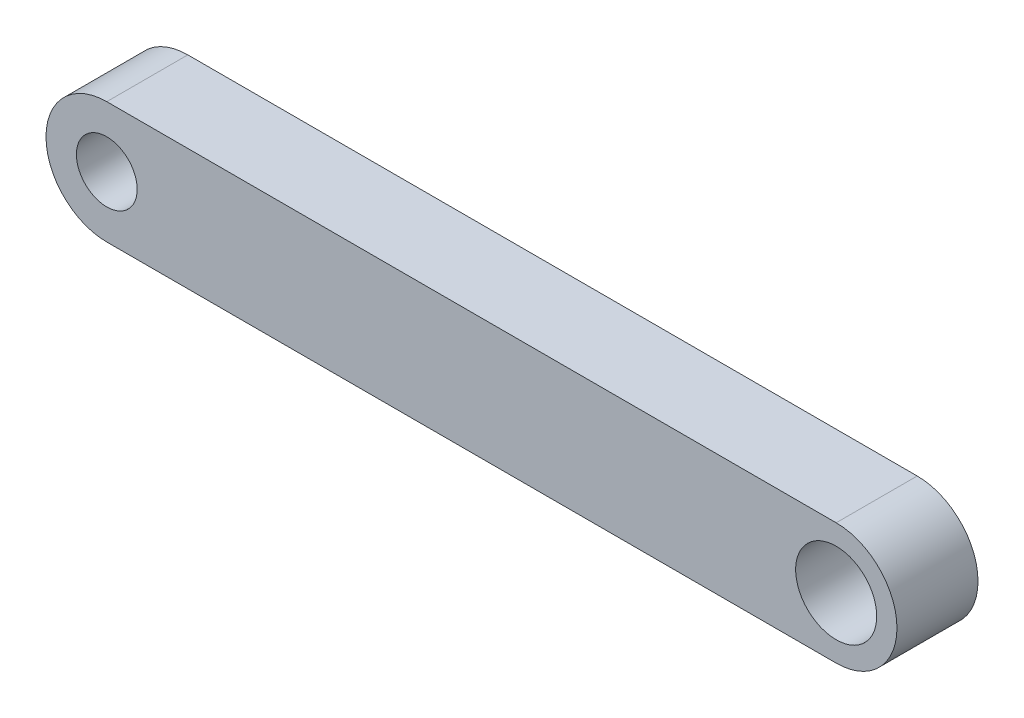
ISO-10303-21;
HEADER;
FILE_DESCRIPTION(('STEP AP214'),'2;1');
FILE_NAME('part.step','',(''),(''),'','','');
FILE_SCHEMA(('AUTOMOTIVE_DESIGN { 1 0 10303 214 1 1 1 1 }'));
ENDSEC;
DATA;
#1=APPLICATION_CONTEXT('core data for automotive mechanical design processes');
#2=APPLICATION_PROTOCOL_DEFINITION('international standard','automotive_design',2000,#1);
#3=PRODUCT_CONTEXT('',#1,'mechanical');
#4=PRODUCT('Part','Part','',(#3));
#5=PRODUCT_RELATED_PRODUCT_CATEGORY('part','',(#4));
#6=PRODUCT_DEFINITION_FORMATION('','',#4);
#7=PRODUCT_DEFINITION_CONTEXT('part definition',#1,'design');
#8=PRODUCT_DEFINITION('design','',#6,#7);
#9=PRODUCT_DEFINITION_SHAPE('','',#8);
#10=(LENGTH_UNIT() NAMED_UNIT(*) SI_UNIT(.MILLI.,.METRE.));
#11=(NAMED_UNIT(*) PLANE_ANGLE_UNIT() SI_UNIT($,.RADIAN.));
#12=(NAMED_UNIT(*) SI_UNIT($,.STERADIAN.) SOLID_ANGLE_UNIT());
#13=UNCERTAINTY_MEASURE_WITH_UNIT(LENGTH_MEASURE(1.E-05),#10,'distance_accuracy_value','');
#14=(GEOMETRIC_REPRESENTATION_CONTEXT(3) GLOBAL_UNCERTAINTY_ASSIGNED_CONTEXT((#13)) GLOBAL_UNIT_ASSIGNED_CONTEXT((#10,
#11,#12)) REPRESENTATION_CONTEXT('',''));
#15=CARTESIAN_POINT('',(0.,0.,0.));
#16=DIRECTION('',(0.,0.,1.));
#17=DIRECTION('',(1.,0.,0.));
#18=AXIS2_PLACEMENT_3D('',#15,#16,#17);
#19=CARTESIAN_POINT('',(-36.,0.,4.));
#20=DIRECTION('',(0.,0.,-1.));
#21=DIRECTION('',(-1.,0.,0.));
#22=AXIS2_PLACEMENT_3D('',#19,#20,#21);
#23=PLANE('',#22);
#24=CARTESIAN_POINT('',(-36.,0.,4.));
#25=DIRECTION('',(0.,0.,1.));
#26=DIRECTION('',(-1.,0.,0.));
#27=AXIS2_PLACEMENT_3D('',#24,#25,#26);
#28=CIRCLE('',#27,3.);
#29=CARTESIAN_POINT('',(-36.,3.,4.));
#30=VERTEX_POINT('',#29);
#31=CARTESIAN_POINT('',(-36.,-3.,4.));
#32=VERTEX_POINT('',#31);
#33=EDGE_CURVE('E91',#30,#32,#28,.T.);
#34=ORIENTED_EDGE('',*,*,#33,.T.);
#35=DIRECTION('',(1.,0.,0.));
#36=VECTOR('',#35,1.);
#37=CARTESIAN_POINT('',(0.,-3.,4.));
#38=LINE('',#37,#36);
#39=CARTESIAN_POINT('',(0.,-3.,4.));
#40=VERTEX_POINT('',#39);
#41=EDGE_CURVE('E86',#32,#40,#38,.T.);
#42=ORIENTED_EDGE('',*,*,#41,.T.);
#43=CARTESIAN_POINT('',(0.,0.,4.));
#44=DIRECTION('',(0.,0.,1.));
#45=DIRECTION('',(1.,0.,0.));
#46=AXIS2_PLACEMENT_3D('',#43,#44,#45);
#47=CIRCLE('',#46,3.);
#48=CARTESIAN_POINT('',(0.,3.,4.));
#49=VERTEX_POINT('',#48);
#50=EDGE_CURVE('E89',#40,#49,#47,.T.);
#51=ORIENTED_EDGE('',*,*,#50,.T.);
#52=DIRECTION('',(-1.,0.,0.));
#53=VECTOR('',#52,1.);
#54=CARTESIAN_POINT('',(0.,3.,4.));
#55=LINE('',#54,#53);
#56=EDGE_CURVE('E56',#49,#30,#55,.T.);
#57=ORIENTED_EDGE('',*,*,#56,.T.);
#58=EDGE_LOOP('',(#34,#42,#51,#57));
#59=FACE_BOUND('',#58,.T.);
#60=CARTESIAN_POINT('',(0.,0.,4.));
#61=DIRECTION('',(0.,0.,1.));
#62=DIRECTION('',(1.,0.,0.));
#63=AXIS2_PLACEMENT_3D('',#60,#61,#62);
#64=CIRCLE('',#63,2.);
#65=CARTESIAN_POINT('',(2.,0.,4.));
#66=VERTEX_POINT('',#65);
#67=EDGE_CURVE('E106',#66,#66,#64,.T.);
#68=ORIENTED_EDGE('',*,*,#67,.F.);
#69=EDGE_LOOP('',(#68));
#70=FACE_BOUND('',#69,.T.);
#71=CARTESIAN_POINT('',(-36.,0.,4.));
#72=DIRECTION('',(0.,0.,1.));
#73=DIRECTION('',(1.,0.,0.));
#74=AXIS2_PLACEMENT_3D('',#71,#72,#73);
#75=CIRCLE('',#74,1.5);
#76=CARTESIAN_POINT('',(-34.5,0.,4.));
#77=VERTEX_POINT('',#76);
#78=EDGE_CURVE('E121',#77,#77,#75,.T.);
#79=ORIENTED_EDGE('',*,*,#78,.F.);
#80=EDGE_LOOP('',(#79));
#81=FACE_BOUND('',#80,.T.);
#82=ADVANCED_FACE('F39',(#59,#70,#81),#23,.F.);
#83=CARTESIAN_POINT('',(-36.,0.,0.));
#84=DIRECTION('',(0.,0.,-1.));
#85=DIRECTION('',(-1.,0.,0.));
#86=AXIS2_PLACEMENT_3D('',#83,#84,#85);
#87=PLANE('',#86);
#88=CARTESIAN_POINT('',(0.,0.,0.));
#89=DIRECTION('',(0.,0.,1.));
#90=DIRECTION('',(1.,0.,0.));
#91=AXIS2_PLACEMENT_3D('',#88,#89,#90);
#92=CIRCLE('',#91,2.);
#93=CARTESIAN_POINT('',(2.,0.,0.));
#94=VERTEX_POINT('',#93);
#95=EDGE_CURVE('E118',#94,#94,#92,.T.);
#96=ORIENTED_EDGE('',*,*,#95,.T.);
#97=EDGE_LOOP('',(#96));
#98=FACE_BOUND('',#97,.T.);
#99=CARTESIAN_POINT('',(-36.,0.,0.));
#100=DIRECTION('',(0.,0.,1.));
#101=DIRECTION('',(-1.,0.,0.));
#102=AXIS2_PLACEMENT_3D('',#99,#100,#101);
#103=CIRCLE('',#102,3.);
#104=CARTESIAN_POINT('',(-36.,3.,0.));
#105=VERTEX_POINT('',#104);
#106=CARTESIAN_POINT('',(-36.,-3.,0.));
#107=VERTEX_POINT('',#106);
#108=EDGE_CURVE('E103',#105,#107,#103,.T.);
#109=ORIENTED_EDGE('',*,*,#108,.F.);
#110=DIRECTION('',(-1.,0.,0.));
#111=VECTOR('',#110,1.);
#112=CARTESIAN_POINT('',(0.,3.,0.));
#113=LINE('',#112,#111);
#114=CARTESIAN_POINT('',(0.,3.,0.));
#115=VERTEX_POINT('',#114);
#116=EDGE_CURVE('E79',#115,#105,#113,.T.);
#117=ORIENTED_EDGE('',*,*,#116,.F.);
#118=CARTESIAN_POINT('',(0.,0.,0.));
#119=DIRECTION('',(0.,0.,1.));
#120=DIRECTION('',(1.,0.,0.));
#121=AXIS2_PLACEMENT_3D('',#118,#119,#120);
#122=CIRCLE('',#121,3.);
#123=CARTESIAN_POINT('',(0.,-3.,0.));
#124=VERTEX_POINT('',#123);
#125=EDGE_CURVE('E73',#124,#115,#122,.T.);
#126=ORIENTED_EDGE('',*,*,#125,.F.);
#127=DIRECTION('',(1.,0.,0.));
#128=VECTOR('',#127,1.);
#129=CARTESIAN_POINT('',(0.,-3.,0.));
#130=LINE('',#129,#128);
#131=EDGE_CURVE('E95',#107,#124,#130,.T.);
#132=ORIENTED_EDGE('',*,*,#131,.F.);
#133=EDGE_LOOP('',(#109,#117,#126,#132));
#134=FACE_BOUND('',#133,.T.);
#135=CARTESIAN_POINT('',(-36.,0.,0.));
#136=DIRECTION('',(0.,0.,1.));
#137=DIRECTION('',(1.,0.,0.));
#138=AXIS2_PLACEMENT_3D('',#135,#136,#137);
#139=CIRCLE('',#138,1.5);
#140=CARTESIAN_POINT('',(-34.5,0.,0.));
#141=VERTEX_POINT('',#140);
#142=EDGE_CURVE('E124',#141,#141,#139,.T.);
#143=ORIENTED_EDGE('',*,*,#142,.T.);
#144=EDGE_LOOP('',(#143));
#145=FACE_BOUND('',#144,.T.);
#146=ADVANCED_FACE('F114',(#98,#134,#145),#87,.T.);
#147=CARTESIAN_POINT('',(-36.,0.,4.));
#148=DIRECTION('',(0.,0.,-1.));
#149=DIRECTION('',(-1.,0.,0.));
#150=AXIS2_PLACEMENT_3D('',#147,#148,#149);
#151=CYLINDRICAL_SURFACE('',#150,3.);
#152=ORIENTED_EDGE('',*,*,#108,.T.);
#153=DIRECTION('',(0.,0.,-1.));
#154=VECTOR('',#153,1.);
#155=CARTESIAN_POINT('',(-36.,-3.,4.));
#156=LINE('',#155,#154);
#157=EDGE_CURVE('E11',#32,#107,#156,.T.);
#158=ORIENTED_EDGE('',*,*,#157,.F.);
#159=ORIENTED_EDGE('',*,*,#33,.F.);
#160=DIRECTION('',(0.,0.,-1.));
#161=VECTOR('',#160,1.);
#162=CARTESIAN_POINT('',(-36.,3.,4.));
#163=LINE('',#162,#161);
#164=EDGE_CURVE('E99',#30,#105,#163,.T.);
#165=ORIENTED_EDGE('',*,*,#164,.T.);
#166=EDGE_LOOP('',(#152,#158,#159,#165));
#167=FACE_BOUND('',#166,.T.);
#168=ADVANCED_FACE('F41',(#167),#151,.T.);
#169=CARTESIAN_POINT('',(0.,-3.,4.));
#170=DIRECTION('',(0.,1.,0.));
#171=DIRECTION('',(-1.,0.,0.));
#172=AXIS2_PLACEMENT_3D('',#169,#170,#171);
#173=PLANE('',#172);
#174=ORIENTED_EDGE('',*,*,#131,.T.);
#175=DIRECTION('',(0.,0.,-1.));
#176=VECTOR('',#175,1.);
#177=CARTESIAN_POINT('',(0.,-3.,4.));
#178=LINE('',#177,#176);
#179=EDGE_CURVE('E48',#40,#124,#178,.T.);
#180=ORIENTED_EDGE('',*,*,#179,.F.);
#181=ORIENTED_EDGE('',*,*,#41,.F.);
#182=ORIENTED_EDGE('',*,*,#157,.T.);
#183=EDGE_LOOP('',(#174,#180,#181,#182));
#184=FACE_BOUND('',#183,.T.);
#185=ADVANCED_FACE('F94',(#184),#173,.F.);
#186=CARTESIAN_POINT('',(0.,0.,4.));
#187=DIRECTION('',(0.,0.,-1.));
#188=DIRECTION('',(-1.,0.,0.));
#189=AXIS2_PLACEMENT_3D('',#186,#187,#188);
#190=CYLINDRICAL_SURFACE('',#189,3.);
#191=ORIENTED_EDGE('',*,*,#125,.T.);
#192=DIRECTION('',(0.,0.,-1.));
#193=VECTOR('',#192,1.);
#194=CARTESIAN_POINT('',(0.,3.,4.));
#195=LINE('',#194,#193);
#196=EDGE_CURVE('E96',#49,#115,#195,.T.);
#197=ORIENTED_EDGE('',*,*,#196,.F.);
#198=ORIENTED_EDGE('',*,*,#50,.F.);
#199=ORIENTED_EDGE('',*,*,#179,.T.);
#200=EDGE_LOOP('',(#191,#197,#198,#199));
#201=FACE_BOUND('',#200,.T.);
#202=ADVANCED_FACE('F97',(#201),#190,.T.);
#203=CARTESIAN_POINT('',(0.,3.,4.));
#204=DIRECTION('',(0.,-1.,0.));
#205=DIRECTION('',(1.,0.,0.));
#206=AXIS2_PLACEMENT_3D('',#203,#204,#205);
#207=PLANE('',#206);
#208=ORIENTED_EDGE('',*,*,#116,.T.);
#209=ORIENTED_EDGE('',*,*,#164,.F.);
#210=ORIENTED_EDGE('',*,*,#56,.F.);
#211=ORIENTED_EDGE('',*,*,#196,.T.);
#212=EDGE_LOOP('',(#208,#209,#210,#211));
#213=FACE_BOUND('',#212,.T.);
#214=ADVANCED_FACE('F111',(#213),#207,.F.);
#215=CARTESIAN_POINT('',(0.,0.,4.));
#216=DIRECTION('',(0.,0.,-1.));
#217=DIRECTION('',(-1.,0.,0.));
#218=AXIS2_PLACEMENT_3D('',#215,#216,#217);
#219=CYLINDRICAL_SURFACE('',#218,2.);
#220=ORIENTED_EDGE('',*,*,#67,.T.);
#221=EDGE_LOOP('',(#220));
#222=FACE_BOUND('',#221,.T.);
#223=ORIENTED_EDGE('',*,*,#95,.F.);
#224=EDGE_LOOP('',(#223));
#225=FACE_BOUND('',#224,.T.);
#226=ADVANCED_FACE('F141',(#222,#225),#219,.F.);
#227=CARTESIAN_POINT('',(-36.,0.,4.));
#228=DIRECTION('',(0.,0.,-1.));
#229=DIRECTION('',(-1.,0.,0.));
#230=AXIS2_PLACEMENT_3D('',#227,#228,#229);
#231=CYLINDRICAL_SURFACE('',#230,1.5);
#232=ORIENTED_EDGE('',*,*,#78,.T.);
#233=EDGE_LOOP('',(#232));
#234=FACE_BOUND('',#233,.T.);
#235=ORIENTED_EDGE('',*,*,#142,.F.);
#236=EDGE_LOOP('',(#235));
#237=FACE_BOUND('',#236,.T.);
#238=ADVANCED_FACE('F130',(#234,#237),#231,.F.);
#239=CLOSED_SHELL('',(#82,#146,#168,#185,#202,#214,#226,#238));
#240=MANIFOLD_SOLID_BREP('B2',#239);
#241=ADVANCED_BREP_SHAPE_REPRESENTATION('',(#18,#240),#14);
#242=SHAPE_DEFINITION_REPRESENTATION(#9,#241);
ENDSEC;
END-ISO-10303-21;
